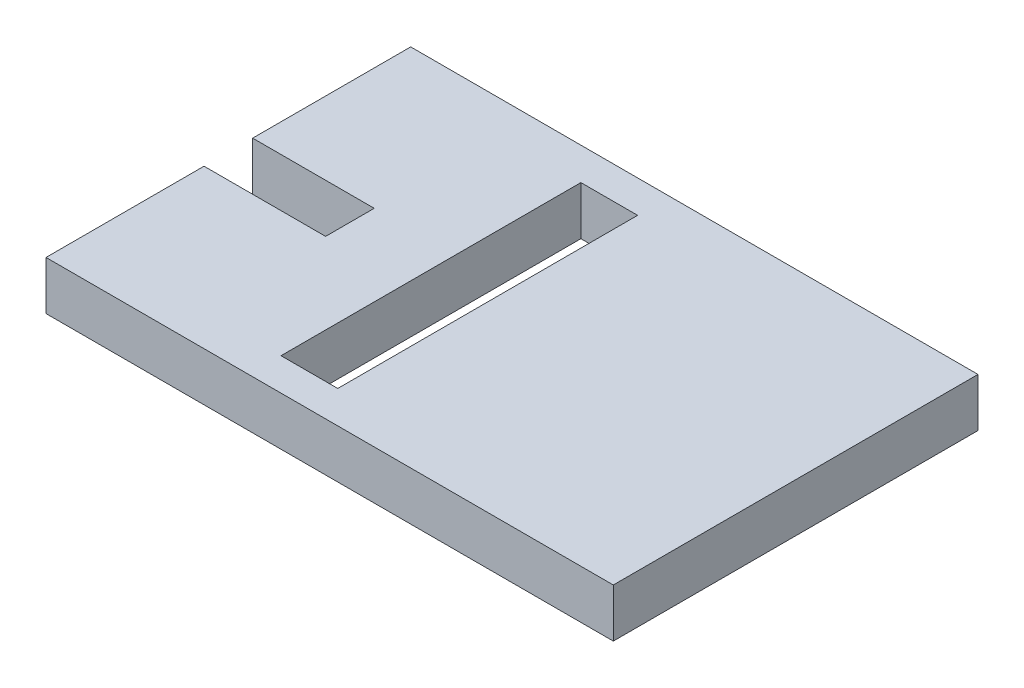
ISO-10303-21;
HEADER;
FILE_DESCRIPTION(('STEP AP214'),'2;1');
FILE_NAME('part.step','',(''),(''),'','','');
FILE_SCHEMA(('AUTOMOTIVE_DESIGN { 1 0 10303 214 1 1 1 1 }'));
ENDSEC;
DATA;
#1=APPLICATION_CONTEXT('core data for automotive mechanical design processes');
#2=APPLICATION_PROTOCOL_DEFINITION('international standard','automotive_design',2000,#1);
#3=PRODUCT_CONTEXT('',#1,'mechanical');
#4=PRODUCT('Part','Part','',(#3));
#5=PRODUCT_RELATED_PRODUCT_CATEGORY('part','',(#4));
#6=PRODUCT_DEFINITION_FORMATION('','',#4);
#7=PRODUCT_DEFINITION_CONTEXT('part definition',#1,'design');
#8=PRODUCT_DEFINITION('design','',#6,#7);
#9=PRODUCT_DEFINITION_SHAPE('','',#8);
#10=(LENGTH_UNIT() NAMED_UNIT(*) SI_UNIT(.MILLI.,.METRE.));
#11=(NAMED_UNIT(*) PLANE_ANGLE_UNIT() SI_UNIT($,.RADIAN.));
#12=(NAMED_UNIT(*) SI_UNIT($,.STERADIAN.) SOLID_ANGLE_UNIT());
#13=UNCERTAINTY_MEASURE_WITH_UNIT(LENGTH_MEASURE(1.E-05),#10,'distance_accuracy_value','');
#14=(GEOMETRIC_REPRESENTATION_CONTEXT(3) GLOBAL_UNCERTAINTY_ASSIGNED_CONTEXT((#13)) GLOBAL_UNIT_ASSIGNED_CONTEXT((#10,
#11,#12)) REPRESENTATION_CONTEXT('',''));
#15=CARTESIAN_POINT('',(0.,0.,0.));
#16=DIRECTION('',(0.,0.,1.));
#17=DIRECTION('',(1.,0.,0.));
#18=AXIS2_PLACEMENT_3D('',#15,#16,#17);
#19=CARTESIAN_POINT('',(0.,6.,0.));
#20=DIRECTION('',(0.,-1.,0.));
#21=DIRECTION('',(0.,0.,-1.));
#22=AXIS2_PLACEMENT_3D('',#19,#20,#21);
#23=PLANE('',#22);
#24=DIRECTION('',(0.,0.,-1.));
#25=VECTOR('',#24,1.);
#26=CARTESIAN_POINT('',(35.,6.,22.5));
#27=LINE('',#26,#25);
#28=CARTESIAN_POINT('',(35.,6.,22.5));
#29=VERTEX_POINT('',#28);
#30=CARTESIAN_POINT('',(35.,6.,-22.5));
#31=VERTEX_POINT('',#30);
#32=EDGE_CURVE('E159',#29,#31,#27,.T.);
#33=ORIENTED_EDGE('',*,*,#32,.T.);
#34=DIRECTION('',(-1.,0.,0.));
#35=VECTOR('',#34,1.);
#36=CARTESIAN_POINT('',(-35.,6.,-22.5));
#37=LINE('',#36,#35);
#38=CARTESIAN_POINT('',(-35.,6.,-22.5));
#39=VERTEX_POINT('',#38);
#40=EDGE_CURVE('E162',#31,#39,#37,.T.);
#41=ORIENTED_EDGE('',*,*,#40,.T.);
#42=DIRECTION('',(0.,0.,1.));
#43=VECTOR('',#42,1.);
#44=CARTESIAN_POINT('',(-35.,6.,-3.));
#45=LINE('',#44,#43);
#46=CARTESIAN_POINT('',(-35.,6.,-3.));
#47=VERTEX_POINT('',#46);
#48=EDGE_CURVE('E165',#39,#47,#45,.T.);
#49=ORIENTED_EDGE('',*,*,#48,.T.);
#50=DIRECTION('',(1.,0.,0.));
#51=VECTOR('',#50,1.);
#52=CARTESIAN_POINT('',(-35.,6.,-3.));
#53=LINE('',#52,#51);
#54=CARTESIAN_POINT('',(-20.,6.,-3.));
#55=VERTEX_POINT('',#54);
#56=EDGE_CURVE('E167',#47,#55,#53,.T.);
#57=ORIENTED_EDGE('',*,*,#56,.T.);
#58=DIRECTION('',(0.,0.,1.));
#59=VECTOR('',#58,1.);
#60=CARTESIAN_POINT('',(-20.,6.,3.));
#61=LINE('',#60,#59);
#62=CARTESIAN_POINT('',(-20.,6.,3.));
#63=VERTEX_POINT('',#62);
#64=EDGE_CURVE('E169',#55,#63,#61,.T.);
#65=ORIENTED_EDGE('',*,*,#64,.T.);
#66=DIRECTION('',(-1.,0.,0.));
#67=VECTOR('',#66,1.);
#68=CARTESIAN_POINT('',(-35.,6.,3.));
#69=LINE('',#68,#67);
#70=CARTESIAN_POINT('',(-35.,6.,3.));
#71=VERTEX_POINT('',#70);
#72=EDGE_CURVE('E171',#63,#71,#69,.T.);
#73=ORIENTED_EDGE('',*,*,#72,.T.);
#74=DIRECTION('',(0.,0.,1.));
#75=VECTOR('',#74,1.);
#76=CARTESIAN_POINT('',(-35.,6.,22.5));
#77=LINE('',#76,#75);
#78=CARTESIAN_POINT('',(-35.,6.,22.5));
#79=VERTEX_POINT('',#78);
#80=EDGE_CURVE('E173',#71,#79,#77,.T.);
#81=ORIENTED_EDGE('',*,*,#80,.T.);
#82=DIRECTION('',(1.,0.,0.));
#83=VECTOR('',#82,1.);
#84=CARTESIAN_POINT('',(-35.,6.,22.5));
#85=LINE('',#84,#83);
#86=EDGE_CURVE('E175',#79,#29,#85,.T.);
#87=ORIENTED_EDGE('',*,*,#86,.T.);
#88=EDGE_LOOP('',(#33,#41,#49,#57,#65,#73,#81,#87));
#89=FACE_BOUND('',#88,.T.);
#90=DIRECTION('',(0.,0.,1.));
#91=VECTOR('',#90,1.);
#92=CARTESIAN_POINT('',(-9.99999999999999,6.,18.5));
#93=LINE('',#92,#91);
#94=CARTESIAN_POINT('',(-9.99999999999999,6.,-18.5));
#95=VERTEX_POINT('',#94);
#96=CARTESIAN_POINT('',(-9.99999999999999,6.,18.5));
#97=VERTEX_POINT('',#96);
#98=EDGE_CURVE('E123',#95,#97,#93,.T.);
#99=ORIENTED_EDGE('',*,*,#98,.F.);
#100=DIRECTION('',(-1.,0.,0.));
#101=VECTOR('',#100,1.);
#102=CARTESIAN_POINT('',(-2.99999999999999,6.,-18.5));
#103=LINE('',#102,#101);
#104=CARTESIAN_POINT('',(-2.99999999999999,6.,-18.5));
#105=VERTEX_POINT('',#104);
#106=EDGE_CURVE('E145',#105,#95,#103,.T.);
#107=ORIENTED_EDGE('',*,*,#106,.F.);
#108=DIRECTION('',(0.,0.,-1.));
#109=VECTOR('',#108,1.);
#110=CARTESIAN_POINT('',(-2.99999999999999,6.,18.5));
#111=LINE('',#110,#109);
#112=CARTESIAN_POINT('',(-2.99999999999999,6.,18.5));
#113=VERTEX_POINT('',#112);
#114=EDGE_CURVE('E143',#113,#105,#111,.T.);
#115=ORIENTED_EDGE('',*,*,#114,.F.);
#116=DIRECTION('',(1.,0.,0.));
#117=VECTOR('',#116,1.);
#118=CARTESIAN_POINT('',(-2.99999999999999,6.,18.5));
#119=LINE('',#118,#117);
#120=EDGE_CURVE('E131',#97,#113,#119,.T.);
#121=ORIENTED_EDGE('',*,*,#120,.F.);
#122=EDGE_LOOP('',(#99,#107,#115,#121));
#123=FACE_BOUND('',#122,.T.);
#124=ADVANCED_FACE('F34',(#89,#123),#23,.F.);
#125=CARTESIAN_POINT('',(0.,0.,0.));
#126=DIRECTION('',(0.,-1.,0.));
#127=DIRECTION('',(0.,0.,-1.));
#128=AXIS2_PLACEMENT_3D('',#125,#126,#127);
#129=PLANE('',#128);
#130=DIRECTION('',(0.,0.,-1.));
#131=VECTOR('',#130,1.);
#132=CARTESIAN_POINT('',(35.,0.,22.5));
#133=LINE('',#132,#131);
#134=CARTESIAN_POINT('',(35.,0.,22.5));
#135=VERTEX_POINT('',#134);
#136=CARTESIAN_POINT('',(35.,0.,-22.5));
#137=VERTEX_POINT('',#136);
#138=EDGE_CURVE('E139',#135,#137,#133,.T.);
#139=ORIENTED_EDGE('',*,*,#138,.F.);
#140=DIRECTION('',(1.,0.,0.));
#141=VECTOR('',#140,1.);
#142=CARTESIAN_POINT('',(-35.,0.,22.5));
#143=LINE('',#142,#141);
#144=CARTESIAN_POINT('',(-35.,0.,22.5));
#145=VERTEX_POINT('',#144);
#146=EDGE_CURVE('E163',#145,#135,#143,.T.);
#147=ORIENTED_EDGE('',*,*,#146,.F.);
#148=DIRECTION('',(0.,0.,1.));
#149=VECTOR('',#148,1.);
#150=CARTESIAN_POINT('',(-35.,0.,22.5));
#151=LINE('',#150,#149);
#152=CARTESIAN_POINT('',(-35.,0.,3.));
#153=VERTEX_POINT('',#152);
#154=EDGE_CURVE('E190',#153,#145,#151,.T.);
#155=ORIENTED_EDGE('',*,*,#154,.F.);
#156=DIRECTION('',(-1.,0.,0.));
#157=VECTOR('',#156,1.);
#158=CARTESIAN_POINT('',(-35.,0.,3.));
#159=LINE('',#158,#157);
#160=CARTESIAN_POINT('',(-20.,0.,3.));
#161=VERTEX_POINT('',#160);
#162=EDGE_CURVE('E188',#161,#153,#159,.T.);
#163=ORIENTED_EDGE('',*,*,#162,.F.);
#164=DIRECTION('',(0.,0.,1.));
#165=VECTOR('',#164,1.);
#166=CARTESIAN_POINT('',(-20.,0.,3.));
#167=LINE('',#166,#165);
#168=CARTESIAN_POINT('',(-20.,0.,-3.));
#169=VERTEX_POINT('',#168);
#170=EDGE_CURVE('E186',#169,#161,#167,.T.);
#171=ORIENTED_EDGE('',*,*,#170,.F.);
#172=DIRECTION('',(1.,0.,0.));
#173=VECTOR('',#172,1.);
#174=CARTESIAN_POINT('',(-35.,0.,-3.));
#175=LINE('',#174,#173);
#176=CARTESIAN_POINT('',(-35.,0.,-3.));
#177=VERTEX_POINT('',#176);
#178=EDGE_CURVE('E184',#177,#169,#175,.T.);
#179=ORIENTED_EDGE('',*,*,#178,.F.);
#180=DIRECTION('',(0.,0.,1.));
#181=VECTOR('',#180,1.);
#182=CARTESIAN_POINT('',(-35.,0.,-3.));
#183=LINE('',#182,#181);
#184=CARTESIAN_POINT('',(-35.,0.,-22.5));
#185=VERTEX_POINT('',#184);
#186=EDGE_CURVE('E182',#185,#177,#183,.T.);
#187=ORIENTED_EDGE('',*,*,#186,.F.);
#188=DIRECTION('',(-1.,0.,0.));
#189=VECTOR('',#188,1.);
#190=CARTESIAN_POINT('',(-35.,0.,-22.5));
#191=LINE('',#190,#189);
#192=EDGE_CURVE('E180',#137,#185,#191,.T.);
#193=ORIENTED_EDGE('',*,*,#192,.F.);
#194=EDGE_LOOP('',(#139,#147,#155,#163,#171,#179,#187,#193));
#195=FACE_BOUND('',#194,.T.);
#196=DIRECTION('',(-1.,0.,0.));
#197=VECTOR('',#196,1.);
#198=CARTESIAN_POINT('',(-2.99999999999999,0.,-18.5));
#199=LINE('',#198,#197);
#200=CARTESIAN_POINT('',(-2.99999999999999,0.,-18.5));
#201=VERTEX_POINT('',#200);
#202=CARTESIAN_POINT('',(-9.99999999999999,0.,-18.5));
#203=VERTEX_POINT('',#202);
#204=EDGE_CURVE('E132',#201,#203,#199,.T.);
#205=ORIENTED_EDGE('',*,*,#204,.T.);
#206=DIRECTION('',(0.,0.,1.));
#207=VECTOR('',#206,1.);
#208=CARTESIAN_POINT('',(-9.99999999999999,0.,18.5));
#209=LINE('',#208,#207);
#210=CARTESIAN_POINT('',(-9.99999999999999,0.,18.5));
#211=VERTEX_POINT('',#210);
#212=EDGE_CURVE('E57',#203,#211,#209,.T.);
#213=ORIENTED_EDGE('',*,*,#212,.T.);
#214=DIRECTION('',(1.,0.,0.));
#215=VECTOR('',#214,1.);
#216=CARTESIAN_POINT('',(-2.99999999999999,0.,18.5));
#217=LINE('',#216,#215);
#218=CARTESIAN_POINT('',(-2.99999999999999,0.,18.5));
#219=VERTEX_POINT('',#218);
#220=EDGE_CURVE('E138',#211,#219,#217,.T.);
#221=ORIENTED_EDGE('',*,*,#220,.T.);
#222=DIRECTION('',(0.,0.,-1.));
#223=VECTOR('',#222,1.);
#224=CARTESIAN_POINT('',(-2.99999999999999,0.,18.5));
#225=LINE('',#224,#223);
#226=EDGE_CURVE('E151',#219,#201,#225,.T.);
#227=ORIENTED_EDGE('',*,*,#226,.T.);
#228=EDGE_LOOP('',(#205,#213,#221,#227));
#229=FACE_BOUND('',#228,.T.);
#230=ADVANCED_FACE('F220',(#195,#229),#129,.T.);
#231=CARTESIAN_POINT('',(35.,6.,22.5));
#232=DIRECTION('',(-1.,0.,0.));
#233=DIRECTION('',(0.,0.,1.));
#234=AXIS2_PLACEMENT_3D('',#231,#232,#233);
#235=PLANE('',#234);
#236=ORIENTED_EDGE('',*,*,#138,.T.);
#237=DIRECTION('',(0.,-1.,0.));
#238=VECTOR('',#237,1.);
#239=CARTESIAN_POINT('',(35.,6.,-22.5));
#240=LINE('',#239,#238);
#241=EDGE_CURVE('E11',#31,#137,#240,.T.);
#242=ORIENTED_EDGE('',*,*,#241,.F.);
#243=ORIENTED_EDGE('',*,*,#32,.F.);
#244=DIRECTION('',(0.,-1.,0.));
#245=VECTOR('',#244,1.);
#246=CARTESIAN_POINT('',(35.,6.,22.5));
#247=LINE('',#246,#245);
#248=EDGE_CURVE('E177',#29,#135,#247,.T.);
#249=ORIENTED_EDGE('',*,*,#248,.T.);
#250=EDGE_LOOP('',(#236,#242,#243,#249));
#251=FACE_BOUND('',#250,.T.);
#252=ADVANCED_FACE('F36',(#251),#235,.F.);
#253=CARTESIAN_POINT('',(-35.,6.,-22.5));
#254=DIRECTION('',(0.,0.,1.));
#255=DIRECTION('',(1.,0.,0.));
#256=AXIS2_PLACEMENT_3D('',#253,#254,#255);
#257=PLANE('',#256);
#258=ORIENTED_EDGE('',*,*,#192,.T.);
#259=DIRECTION('',(0.,-1.,0.));
#260=VECTOR('',#259,1.);
#261=CARTESIAN_POINT('',(-35.,6.,-22.5));
#262=LINE('',#261,#260);
#263=EDGE_CURVE('E42',#39,#185,#262,.T.);
#264=ORIENTED_EDGE('',*,*,#263,.F.);
#265=ORIENTED_EDGE('',*,*,#40,.F.);
#266=ORIENTED_EDGE('',*,*,#241,.T.);
#267=EDGE_LOOP('',(#258,#264,#265,#266));
#268=FACE_BOUND('',#267,.T.);
#269=ADVANCED_FACE('F237',(#268),#257,.F.);
#270=CARTESIAN_POINT('',(-35.,6.,-3.));
#271=DIRECTION('',(1.,0.,0.));
#272=DIRECTION('',(0.,0.,-1.));
#273=AXIS2_PLACEMENT_3D('',#270,#271,#272);
#274=PLANE('',#273);
#275=ORIENTED_EDGE('',*,*,#186,.T.);
#276=DIRECTION('',(0.,-1.,0.));
#277=VECTOR('',#276,1.);
#278=CARTESIAN_POINT('',(-35.,6.,-3.));
#279=LINE('',#278,#277);
#280=EDGE_CURVE('E207',#47,#177,#279,.T.);
#281=ORIENTED_EDGE('',*,*,#280,.F.);
#282=ORIENTED_EDGE('',*,*,#48,.F.);
#283=ORIENTED_EDGE('',*,*,#263,.T.);
#284=EDGE_LOOP('',(#275,#281,#282,#283));
#285=FACE_BOUND('',#284,.T.);
#286=ADVANCED_FACE('F214',(#285),#274,.F.);
#287=CARTESIAN_POINT('',(-35.,6.,-3.));
#288=DIRECTION('',(0.,0.,-1.));
#289=DIRECTION('',(-1.,0.,0.));
#290=AXIS2_PLACEMENT_3D('',#287,#288,#289);
#291=PLANE('',#290);
#292=ORIENTED_EDGE('',*,*,#178,.T.);
#293=DIRECTION('',(0.,-1.,0.));
#294=VECTOR('',#293,1.);
#295=CARTESIAN_POINT('',(-20.,6.,-3.));
#296=LINE('',#295,#294);
#297=EDGE_CURVE('E204',#55,#169,#296,.T.);
#298=ORIENTED_EDGE('',*,*,#297,.F.);
#299=ORIENTED_EDGE('',*,*,#56,.F.);
#300=ORIENTED_EDGE('',*,*,#280,.T.);
#301=EDGE_LOOP('',(#292,#298,#299,#300));
#302=FACE_BOUND('',#301,.T.);
#303=ADVANCED_FACE('F226',(#302),#291,.F.);
#304=CARTESIAN_POINT('',(-20.,6.,3.));
#305=DIRECTION('',(1.,0.,0.));
#306=DIRECTION('',(0.,0.,-1.));
#307=AXIS2_PLACEMENT_3D('',#304,#305,#306);
#308=PLANE('',#307);
#309=ORIENTED_EDGE('',*,*,#170,.T.);
#310=DIRECTION('',(0.,-1.,0.));
#311=VECTOR('',#310,1.);
#312=CARTESIAN_POINT('',(-20.,6.,3.));
#313=LINE('',#312,#311);
#314=EDGE_CURVE('E201',#63,#161,#313,.T.);
#315=ORIENTED_EDGE('',*,*,#314,.F.);
#316=ORIENTED_EDGE('',*,*,#64,.F.);
#317=ORIENTED_EDGE('',*,*,#297,.T.);
#318=EDGE_LOOP('',(#309,#315,#316,#317));
#319=FACE_BOUND('',#318,.T.);
#320=ADVANCED_FACE('F230',(#319),#308,.F.);
#321=CARTESIAN_POINT('',(-35.,6.,3.));
#322=DIRECTION('',(0.,0.,1.));
#323=DIRECTION('',(1.,0.,0.));
#324=AXIS2_PLACEMENT_3D('',#321,#322,#323);
#325=PLANE('',#324);
#326=ORIENTED_EDGE('',*,*,#162,.T.);
#327=DIRECTION('',(0.,-1.,0.));
#328=VECTOR('',#327,1.);
#329=CARTESIAN_POINT('',(-35.,6.,3.));
#330=LINE('',#329,#328);
#331=EDGE_CURVE('E198',#71,#153,#330,.T.);
#332=ORIENTED_EDGE('',*,*,#331,.F.);
#333=ORIENTED_EDGE('',*,*,#72,.F.);
#334=ORIENTED_EDGE('',*,*,#314,.T.);
#335=EDGE_LOOP('',(#326,#332,#333,#334));
#336=FACE_BOUND('',#335,.T.);
#337=ADVANCED_FACE('F250',(#336),#325,.F.);
#338=CARTESIAN_POINT('',(-35.,6.,22.5));
#339=DIRECTION('',(1.,0.,0.));
#340=DIRECTION('',(0.,0.,-1.));
#341=AXIS2_PLACEMENT_3D('',#338,#339,#340);
#342=PLANE('',#341);
#343=ORIENTED_EDGE('',*,*,#154,.T.);
#344=DIRECTION('',(0.,-1.,0.));
#345=VECTOR('',#344,1.);
#346=CARTESIAN_POINT('',(-35.,6.,22.5));
#347=LINE('',#346,#345);
#348=EDGE_CURVE('E195',#79,#145,#347,.T.);
#349=ORIENTED_EDGE('',*,*,#348,.F.);
#350=ORIENTED_EDGE('',*,*,#80,.F.);
#351=ORIENTED_EDGE('',*,*,#331,.T.);
#352=EDGE_LOOP('',(#343,#349,#350,#351));
#353=FACE_BOUND('',#352,.T.);
#354=ADVANCED_FACE('F248',(#353),#342,.F.);
#355=CARTESIAN_POINT('',(-35.,6.,22.5));
#356=DIRECTION('',(0.,0.,-1.));
#357=DIRECTION('',(-1.,0.,0.));
#358=AXIS2_PLACEMENT_3D('',#355,#356,#357);
#359=PLANE('',#358);
#360=ORIENTED_EDGE('',*,*,#146,.T.);
#361=ORIENTED_EDGE('',*,*,#248,.F.);
#362=ORIENTED_EDGE('',*,*,#86,.F.);
#363=ORIENTED_EDGE('',*,*,#348,.T.);
#364=EDGE_LOOP('',(#360,#361,#362,#363));
#365=FACE_BOUND('',#364,.T.);
#366=ADVANCED_FACE('F243',(#365),#359,.F.);
#367=CARTESIAN_POINT('',(-9.99999999999999,6.,18.5));
#368=DIRECTION('',(1.,0.,0.));
#369=DIRECTION('',(0.,0.,-1.));
#370=AXIS2_PLACEMENT_3D('',#367,#368,#369);
#371=PLANE('',#370);
#372=ORIENTED_EDGE('',*,*,#212,.F.);
#373=DIRECTION('',(0.,-1.,0.));
#374=VECTOR('',#373,1.);
#375=CARTESIAN_POINT('',(-9.99999999999999,6.,-18.5));
#376=LINE('',#375,#374);
#377=EDGE_CURVE('E127',#95,#203,#376,.T.);
#378=ORIENTED_EDGE('',*,*,#377,.F.);
#379=ORIENTED_EDGE('',*,*,#98,.T.);
#380=DIRECTION('',(0.,-1.,0.));
#381=VECTOR('',#380,1.);
#382=CARTESIAN_POINT('',(-9.99999999999999,6.,18.5));
#383=LINE('',#382,#381);
#384=EDGE_CURVE('E126',#97,#211,#383,.T.);
#385=ORIENTED_EDGE('',*,*,#384,.T.);
#386=EDGE_LOOP('',(#372,#378,#379,#385));
#387=FACE_BOUND('',#386,.T.);
#388=ADVANCED_FACE('F125',(#387),#371,.T.);
#389=CARTESIAN_POINT('',(-2.99999999999999,6.,18.5));
#390=DIRECTION('',(0.,0.,-1.));
#391=DIRECTION('',(-1.,0.,0.));
#392=AXIS2_PLACEMENT_3D('',#389,#390,#391);
#393=PLANE('',#392);
#394=ORIENTED_EDGE('',*,*,#220,.F.);
#395=ORIENTED_EDGE('',*,*,#384,.F.);
#396=ORIENTED_EDGE('',*,*,#120,.T.);
#397=DIRECTION('',(0.,-1.,0.));
#398=VECTOR('',#397,1.);
#399=CARTESIAN_POINT('',(-2.99999999999999,6.,18.5));
#400=LINE('',#399,#398);
#401=EDGE_CURVE('E140',#113,#219,#400,.T.);
#402=ORIENTED_EDGE('',*,*,#401,.T.);
#403=EDGE_LOOP('',(#394,#395,#396,#402));
#404=FACE_BOUND('',#403,.T.);
#405=ADVANCED_FACE('F135',(#404),#393,.T.);
#406=CARTESIAN_POINT('',(-2.99999999999999,6.,18.5));
#407=DIRECTION('',(-1.,0.,0.));
#408=DIRECTION('',(0.,0.,1.));
#409=AXIS2_PLACEMENT_3D('',#406,#407,#408);
#410=PLANE('',#409);
#411=ORIENTED_EDGE('',*,*,#226,.F.);
#412=ORIENTED_EDGE('',*,*,#401,.F.);
#413=ORIENTED_EDGE('',*,*,#114,.T.);
#414=DIRECTION('',(0.,-1.,0.));
#415=VECTOR('',#414,1.);
#416=CARTESIAN_POINT('',(-2.99999999999999,6.,-18.5));
#417=LINE('',#416,#415);
#418=EDGE_CURVE('E49',#105,#201,#417,.T.);
#419=ORIENTED_EDGE('',*,*,#418,.T.);
#420=EDGE_LOOP('',(#411,#412,#413,#419));
#421=FACE_BOUND('',#420,.T.);
#422=ADVANCED_FACE('F275',(#421),#410,.T.);
#423=CARTESIAN_POINT('',(-2.99999999999999,6.,-18.5));
#424=DIRECTION('',(0.,0.,1.));
#425=DIRECTION('',(1.,0.,0.));
#426=AXIS2_PLACEMENT_3D('',#423,#424,#425);
#427=PLANE('',#426);
#428=ORIENTED_EDGE('',*,*,#204,.F.);
#429=ORIENTED_EDGE('',*,*,#418,.F.);
#430=ORIENTED_EDGE('',*,*,#106,.T.);
#431=ORIENTED_EDGE('',*,*,#377,.T.);
#432=EDGE_LOOP('',(#428,#429,#430,#431));
#433=FACE_BOUND('',#432,.T.);
#434=ADVANCED_FACE('F279',(#433),#427,.T.);
#435=CLOSED_SHELL('',(#124,#230,#252,#269,#286,#303,#320,#337,#354,#366,#388,#405,#422,#434));
#436=MANIFOLD_SOLID_BREP('B2',#435);
#437=ADVANCED_BREP_SHAPE_REPRESENTATION('',(#18,#436),#14);
#438=SHAPE_DEFINITION_REPRESENTATION(#9,#437);
ENDSEC;
END-ISO-10303-21;
